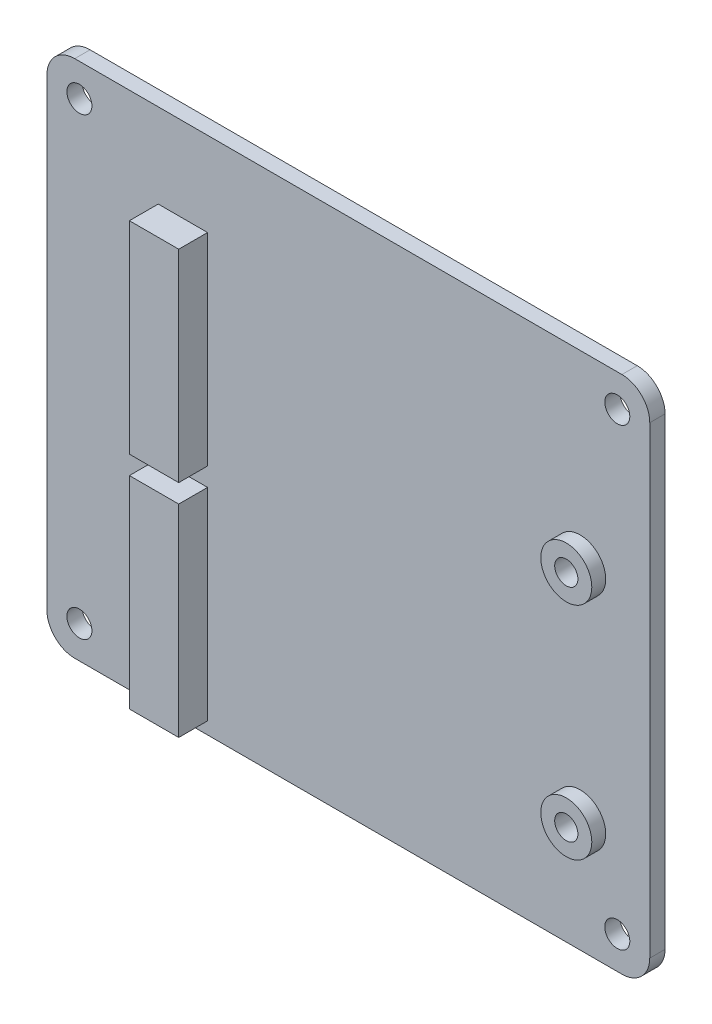
ISO-10303-21;
HEADER;
FILE_DESCRIPTION(('STEP AP214'),'2;1');
FILE_NAME('part.step','',(''),(''),'','','');
FILE_SCHEMA(('AUTOMOTIVE_DESIGN { 1 0 10303 214 1 1 1 1 }'));
ENDSEC;
DATA;
#1=APPLICATION_CONTEXT('core data for automotive mechanical design processes');
#2=APPLICATION_PROTOCOL_DEFINITION('international standard','automotive_design',2000,#1);
#3=PRODUCT_CONTEXT('',#1,'mechanical');
#4=PRODUCT('Part','Part','',(#3));
#5=PRODUCT_RELATED_PRODUCT_CATEGORY('part','',(#4));
#6=PRODUCT_DEFINITION_FORMATION('','',#4);
#7=PRODUCT_DEFINITION_CONTEXT('part definition',#1,'design');
#8=PRODUCT_DEFINITION('design','',#6,#7);
#9=PRODUCT_DEFINITION_SHAPE('','',#8);
#10=(LENGTH_UNIT() NAMED_UNIT(*) SI_UNIT(.MILLI.,.METRE.));
#11=(NAMED_UNIT(*) PLANE_ANGLE_UNIT() SI_UNIT($,.RADIAN.));
#12=(NAMED_UNIT(*) SI_UNIT($,.STERADIAN.) SOLID_ANGLE_UNIT());
#13=UNCERTAINTY_MEASURE_WITH_UNIT(LENGTH_MEASURE(1.E-05),#10,'distance_accuracy_value','');
#14=(GEOMETRIC_REPRESENTATION_CONTEXT(3) GLOBAL_UNCERTAINTY_ASSIGNED_CONTEXT((#13)) GLOBAL_UNIT_ASSIGNED_CONTEXT((#10,
#11,#12)) REPRESENTATION_CONTEXT('',''));
#15=CARTESIAN_POINT('',(0.,0.,0.));
#16=DIRECTION('',(0.,0.,1.));
#17=DIRECTION('',(1.,0.,0.));
#18=AXIS2_PLACEMENT_3D('',#15,#16,#17);
#19=CARTESIAN_POINT('',(-10.7638714223459,176.226790528079,-199.671110375751));
#20=DIRECTION('',(0.,0.,-1.));
#21=DIRECTION('',(-1.,0.,0.));
#22=AXIS2_PLACEMENT_3D('',#19,#20,#21);
#23=PLANE('',#22);
#24=CARTESIAN_POINT('',(-15.2638714223459,159.246790528079,-199.671110375751));
#25=DIRECTION('',(0.,0.,-1.));
#26=DIRECTION('',(-1.,0.,0.));
#27=AXIS2_PLACEMENT_3D('',#24,#25,#26);
#28=CIRCLE('',#27,2.75);
#29=CARTESIAN_POINT('',(-18.0138714223459,159.246790528079,-199.671110375751));
#30=VERTEX_POINT('',#29);
#31=EDGE_CURVE('E11',#30,#30,#28,.F.);
#32=ORIENTED_EDGE('',*,*,#31,.F.);
#33=EDGE_LOOP('',(#32));
#34=FACE_BOUND('',#33,.T.);
#35=CARTESIAN_POINT('',(-15.2638714223459,135.446790528079,-199.671110375751));
#36=DIRECTION('',(0.,0.,-1.));
#37=DIRECTION('',(-1.,0.,0.));
#38=AXIS2_PLACEMENT_3D('',#35,#36,#37);
#39=CIRCLE('',#38,2.75);
#40=CARTESIAN_POINT('',(-18.0138714223459,135.446790528079,-199.671110375751));
#41=VERTEX_POINT('',#40);
#42=EDGE_CURVE('E46',#41,#41,#39,.F.);
#43=ORIENTED_EDGE('',*,*,#42,.F.);
#44=EDGE_LOOP('',(#43));
#45=FACE_BOUND('',#44,.T.);
#46=DIRECTION('',(0.,-1.,0.));
#47=VECTOR('',#46,1.);
#48=CARTESIAN_POINT('',(-60.7638714223459,170.146790528079,-199.671110375751));
#49=LINE('',#48,#47);
#50=CARTESIAN_POINT('',(-60.7638714223459,170.146790528079,-199.671110375751));
#51=VERTEX_POINT('',#50);
#52=CARTESIAN_POINT('',(-60.7638714223459,148.346790528079,-199.671110375751));
#53=VERTEX_POINT('',#52);
#54=EDGE_CURVE('E153',#51,#53,#49,.T.);
#55=ORIENTED_EDGE('',*,*,#54,.F.);
#56=DIRECTION('',(-1.,0.,0.));
#57=VECTOR('',#56,1.);
#58=CARTESIAN_POINT('',(-60.7638714223459,170.146790528079,-199.671110375751));
#59=LINE('',#58,#57);
#60=CARTESIAN_POINT('',(-55.4438714223459,170.146790528079,-199.671110375751));
#61=VERTEX_POINT('',#60);
#62=EDGE_CURVE('E186',#61,#51,#59,.T.);
#63=ORIENTED_EDGE('',*,*,#62,.F.);
#64=DIRECTION('',(0.,1.,0.));
#65=VECTOR('',#64,1.);
#66=CARTESIAN_POINT('',(-55.4438714223459,170.146790528079,-199.671110375751));
#67=LINE('',#66,#65);
#68=CARTESIAN_POINT('',(-55.4438714223459,148.346790528079,-199.671110375751));
#69=VERTEX_POINT('',#68);
#70=EDGE_CURVE('E198',#69,#61,#67,.T.);
#71=ORIENTED_EDGE('',*,*,#70,.F.);
#72=DIRECTION('',(1.,0.,0.));
#73=VECTOR('',#72,1.);
#74=CARTESIAN_POINT('',(-60.7638714223459,148.346790528079,-199.671110375751));
#75=LINE('',#74,#73);
#76=EDGE_CURVE('E195',#53,#69,#75,.T.);
#77=ORIENTED_EDGE('',*,*,#76,.F.);
#78=EDGE_LOOP('',(#55,#63,#71,#77));
#79=FACE_BOUND('',#78,.T.);
#80=CARTESIAN_POINT('',(-11.2638714223459,175.726790528079,-199.671110375751));
#81=DIRECTION('',(0.,0.,1.));
#82=DIRECTION('',(1.,0.,0.));
#83=AXIS2_PLACEMENT_3D('',#80,#81,#82);
#84=CIRCLE('',#83,1.34999999999998);
#85=CARTESIAN_POINT('',(-9.91387142234592,175.726790528079,-199.671110375751));
#86=VERTEX_POINT('',#85);
#87=EDGE_CURVE('E221',#86,#86,#84,.T.);
#88=ORIENTED_EDGE('',*,*,#87,.F.);
#89=EDGE_LOOP('',(#88));
#90=FACE_BOUND('',#89,.T.);
#91=CARTESIAN_POINT('',(-69.2638714223459,126.726790528079,-199.671110375751));
#92=DIRECTION('',(0.,0.,1.));
#93=DIRECTION('',(1.,0.,0.));
#94=AXIS2_PLACEMENT_3D('',#91,#92,#93);
#95=CIRCLE('',#94,1.35);
#96=CARTESIAN_POINT('',(-67.9138714223459,126.726790528079,-199.671110375751));
#97=VERTEX_POINT('',#96);
#98=EDGE_CURVE('E228',#97,#97,#95,.T.);
#99=ORIENTED_EDGE('',*,*,#98,.F.);
#100=EDGE_LOOP('',(#99));
#101=FACE_BOUND('',#100,.T.);
#102=CARTESIAN_POINT('',(-11.2638714223459,126.726790528079,-199.671110375751));
#103=DIRECTION('',(0.,0.,1.));
#104=DIRECTION('',(1.,0.,0.));
#105=AXIS2_PLACEMENT_3D('',#102,#103,#104);
#106=CIRCLE('',#105,1.34999999999998);
#107=CARTESIAN_POINT('',(-9.91387142234592,126.726790528079,-199.671110375751));
#108=VERTEX_POINT('',#107);
#109=EDGE_CURVE('E215',#108,#108,#106,.T.);
#110=ORIENTED_EDGE('',*,*,#109,.F.);
#111=EDGE_LOOP('',(#110));
#112=FACE_BOUND('',#111,.T.);
#113=CARTESIAN_POINT('',(-69.2638714223459,175.726790528079,-199.671110375751));
#114=DIRECTION('',(0.,0.,1.));
#115=DIRECTION('',(1.,0.,0.));
#116=AXIS2_PLACEMENT_3D('',#113,#114,#115);
#117=CIRCLE('',#116,1.35);
#118=CARTESIAN_POINT('',(-67.9138714223459,175.726790528079,-199.671110375751));
#119=VERTEX_POINT('',#118);
#120=EDGE_CURVE('E224',#119,#119,#117,.T.);
#121=ORIENTED_EDGE('',*,*,#120,.F.);
#122=EDGE_LOOP('',(#121));
#123=FACE_BOUND('',#122,.T.);
#124=CARTESIAN_POINT('',(-10.7638714223459,176.226790528079,-199.671110375751));
#125=DIRECTION('',(0.,0.,1.));
#126=DIRECTION('',(-1.,0.,0.));
#127=AXIS2_PLACEMENT_3D('',#124,#125,#126);
#128=CIRCLE('',#127,3.);
#129=CARTESIAN_POINT('',(-7.76387142234591,176.226790528079,-199.671110375751));
#130=VERTEX_POINT('',#129);
#131=CARTESIAN_POINT('',(-10.7638714223459,179.226790528079,-199.671110375751));
#132=VERTEX_POINT('',#131);
#133=EDGE_CURVE('E239',#130,#132,#128,.T.);
#134=ORIENTED_EDGE('',*,*,#133,.T.);
#135=DIRECTION('',(-1.,0.,0.));
#136=VECTOR('',#135,1.);
#137=CARTESIAN_POINT('',(-69.7638714223459,179.226790528079,-199.671110375751));
#138=LINE('',#137,#136);
#139=CARTESIAN_POINT('',(-69.7638714223459,179.226790528079,-199.671110375751));
#140=VERTEX_POINT('',#139);
#141=EDGE_CURVE('E242',#132,#140,#138,.T.);
#142=ORIENTED_EDGE('',*,*,#141,.T.);
#143=CARTESIAN_POINT('',(-69.7638714223459,176.226790528079,-199.671110375751));
#144=DIRECTION('',(0.,0.,1.));
#145=DIRECTION('',(1.,0.,0.));
#146=AXIS2_PLACEMENT_3D('',#143,#144,#145);
#147=CIRCLE('',#146,3.);
#148=CARTESIAN_POINT('',(-72.7638714223459,176.226790528079,-199.671110375751));
#149=VERTEX_POINT('',#148);
#150=EDGE_CURVE('E245',#140,#149,#147,.T.);
#151=ORIENTED_EDGE('',*,*,#150,.T.);
#152=DIRECTION('',(0.,-1.,0.));
#153=VECTOR('',#152,1.);
#154=CARTESIAN_POINT('',(-72.7638714223459,176.226790528079,-199.671110375751));
#155=LINE('',#154,#153);
#156=CARTESIAN_POINT('',(-72.7638714223459,126.226790528079,-199.671110375751));
#157=VERTEX_POINT('',#156);
#158=EDGE_CURVE('E247',#149,#157,#155,.T.);
#159=ORIENTED_EDGE('',*,*,#158,.T.);
#160=CARTESIAN_POINT('',(-69.7638714223459,126.226790528079,-199.671110375751));
#161=DIRECTION('',(0.,0.,1.));
#162=DIRECTION('',(1.,0.,0.));
#163=AXIS2_PLACEMENT_3D('',#160,#161,#162);
#164=CIRCLE('',#163,3.);
#165=CARTESIAN_POINT('',(-69.7638714223459,123.226790528079,-199.671110375751));
#166=VERTEX_POINT('',#165);
#167=EDGE_CURVE('E249',#157,#166,#164,.T.);
#168=ORIENTED_EDGE('',*,*,#167,.T.);
#169=DIRECTION('',(1.,0.,0.));
#170=VECTOR('',#169,1.);
#171=CARTESIAN_POINT('',(-69.7638714223459,123.226790528079,-199.671110375751));
#172=LINE('',#171,#170);
#173=CARTESIAN_POINT('',(-10.7638714223459,123.226790528079,-199.671110375751));
#174=VERTEX_POINT('',#173);
#175=EDGE_CURVE('E251',#166,#174,#172,.T.);
#176=ORIENTED_EDGE('',*,*,#175,.T.);
#177=CARTESIAN_POINT('',(-10.7638714223459,126.226790528079,-199.671110375751));
#178=DIRECTION('',(0.,0.,1.));
#179=DIRECTION('',(1.,0.,0.));
#180=AXIS2_PLACEMENT_3D('',#177,#178,#179);
#181=CIRCLE('',#180,3.);
#182=CARTESIAN_POINT('',(-7.76387142234591,126.226790528079,-199.671110375751));
#183=VERTEX_POINT('',#182);
#184=EDGE_CURVE('E253',#174,#183,#181,.T.);
#185=ORIENTED_EDGE('',*,*,#184,.T.);
#186=DIRECTION('',(0.,1.,0.));
#187=VECTOR('',#186,1.);
#188=CARTESIAN_POINT('',(-7.76387142234591,176.226790528079,-199.671110375751));
#189=LINE('',#188,#187);
#190=EDGE_CURVE('E255',#183,#130,#189,.T.);
#191=ORIENTED_EDGE('',*,*,#190,.T.);
#192=EDGE_LOOP('',(#134,#142,#151,#159,#168,#176,#185,#191));
#193=FACE_BOUND('',#192,.T.);
#194=DIRECTION('',(0.,-1.,0.));
#195=VECTOR('',#194,1.);
#196=CARTESIAN_POINT('',(-60.7638714223459,146.346790528079,-199.671110375751));
#197=LINE('',#196,#195);
#198=CARTESIAN_POINT('',(-60.7638714223459,146.346790528079,-199.671110375751));
#199=VERTEX_POINT('',#198);
#200=CARTESIAN_POINT('',(-60.7638714223459,124.546790528079,-199.671110375751));
#201=VERTEX_POINT('',#200);
#202=EDGE_CURVE('E147',#199,#201,#197,.T.);
#203=ORIENTED_EDGE('',*,*,#202,.F.);
#204=DIRECTION('',(-1.,0.,0.));
#205=VECTOR('',#204,1.);
#206=CARTESIAN_POINT('',(-60.7638714223459,146.346790528079,-199.671110375751));
#207=LINE('',#206,#205);
#208=CARTESIAN_POINT('',(-55.4438714223459,146.346790528079,-199.671110375751));
#209=VERTEX_POINT('',#208);
#210=EDGE_CURVE('E149',#209,#199,#207,.T.);
#211=ORIENTED_EDGE('',*,*,#210,.F.);
#212=DIRECTION('',(0.,1.,0.));
#213=VECTOR('',#212,1.);
#214=CARTESIAN_POINT('',(-55.4438714223459,146.346790528079,-199.671110375751));
#215=LINE('',#214,#213);
#216=CARTESIAN_POINT('',(-55.4438714223459,124.546790528079,-199.671110375751));
#217=VERTEX_POINT('',#216);
#218=EDGE_CURVE('E58',#217,#209,#215,.T.);
#219=ORIENTED_EDGE('',*,*,#218,.F.);
#220=DIRECTION('',(1.,0.,0.));
#221=VECTOR('',#220,1.);
#222=CARTESIAN_POINT('',(-60.7638714223459,124.546790528079,-199.671110375751));
#223=LINE('',#222,#221);
#224=EDGE_CURVE('E53',#201,#217,#223,.T.);
#225=ORIENTED_EDGE('',*,*,#224,.F.);
#226=EDGE_LOOP('',(#203,#211,#219,#225));
#227=FACE_BOUND('',#226,.T.);
#228=ADVANCED_FACE('F38',(#34,#45,#79,#90,#101,#112,#123,#193,#227),#23,.F.);
#229=CARTESIAN_POINT('',(-10.7638714223459,176.226790528079,-199.671110375751));
#230=DIRECTION('',(0.,0.,-1.));
#231=DIRECTION('',(-1.,0.,0.));
#232=AXIS2_PLACEMENT_3D('',#229,#230,#231);
#233=CYLINDRICAL_SURFACE('',#232,3.);
#234=CARTESIAN_POINT('',(-10.7638714223459,176.226790528079,-201.321110375751));
#235=DIRECTION('',(0.,0.,1.));
#236=DIRECTION('',(-1.,0.,0.));
#237=AXIS2_PLACEMENT_3D('',#234,#235,#236);
#238=CIRCLE('',#237,3.);
#239=CARTESIAN_POINT('',(-7.76387142234591,176.226790528079,-201.321110375751));
#240=VERTEX_POINT('',#239);
#241=CARTESIAN_POINT('',(-10.7638714223459,179.226790528079,-201.321110375751));
#242=VERTEX_POINT('',#241);
#243=EDGE_CURVE('E236',#240,#242,#238,.T.);
#244=ORIENTED_EDGE('',*,*,#243,.T.);
#245=DIRECTION('',(0.,0.,-1.));
#246=VECTOR('',#245,1.);
#247=CARTESIAN_POINT('',(-10.7638714223459,179.226790528079,-199.671110375751));
#248=LINE('',#247,#246);
#249=EDGE_CURVE('E293',#132,#242,#248,.T.);
#250=ORIENTED_EDGE('',*,*,#249,.F.);
#251=ORIENTED_EDGE('',*,*,#133,.F.);
#252=DIRECTION('',(0.,0.,-1.));
#253=VECTOR('',#252,1.);
#254=CARTESIAN_POINT('',(-7.76387142234591,176.226790528079,-199.671110375751));
#255=LINE('',#254,#253);
#256=EDGE_CURVE('E257',#130,#240,#255,.T.);
#257=ORIENTED_EDGE('',*,*,#256,.T.);
#258=EDGE_LOOP('',(#244,#250,#251,#257));
#259=FACE_BOUND('',#258,.T.);
#260=ADVANCED_FACE('F40',(#259),#233,.T.);
#261=CARTESIAN_POINT('',(-69.7638714223459,179.226790528079,-199.671110375751));
#262=DIRECTION('',(0.,-1.,0.));
#263=DIRECTION('',(0.,0.,-1.));
#264=AXIS2_PLACEMENT_3D('',#261,#262,#263);
#265=PLANE('',#264);
#266=DIRECTION('',(-1.,0.,0.));
#267=VECTOR('',#266,1.);
#268=CARTESIAN_POINT('',(-69.7638714223459,179.226790528079,-201.321110375751));
#269=LINE('',#268,#267);
#270=CARTESIAN_POINT('',(-69.7638714223459,179.226790528079,-201.321110375751));
#271=VERTEX_POINT('',#270);
#272=EDGE_CURVE('E260',#242,#271,#269,.T.);
#273=ORIENTED_EDGE('',*,*,#272,.T.);
#274=DIRECTION('',(0.,0.,-1.));
#275=VECTOR('',#274,1.);
#276=CARTESIAN_POINT('',(-69.7638714223459,179.226790528079,-199.671110375751));
#277=LINE('',#276,#275);
#278=EDGE_CURVE('E290',#140,#271,#277,.T.);
#279=ORIENTED_EDGE('',*,*,#278,.F.);
#280=ORIENTED_EDGE('',*,*,#141,.F.);
#281=ORIENTED_EDGE('',*,*,#249,.T.);
#282=EDGE_LOOP('',(#273,#279,#280,#281));
#283=FACE_BOUND('',#282,.T.);
#284=ADVANCED_FACE('F321',(#283),#265,.F.);
#285=CARTESIAN_POINT('',(-69.7638714223459,176.226790528079,-199.671110375751));
#286=DIRECTION('',(0.,0.,-1.));
#287=DIRECTION('',(-1.,0.,0.));
#288=AXIS2_PLACEMENT_3D('',#285,#286,#287);
#289=CYLINDRICAL_SURFACE('',#288,3.);
#290=CARTESIAN_POINT('',(-69.7638714223459,176.226790528079,-201.321110375751));
#291=DIRECTION('',(0.,0.,1.));
#292=DIRECTION('',(1.,0.,0.));
#293=AXIS2_PLACEMENT_3D('',#290,#291,#292);
#294=CIRCLE('',#293,3.);
#295=CARTESIAN_POINT('',(-72.7638714223459,176.226790528079,-201.321110375751));
#296=VERTEX_POINT('',#295);
#297=EDGE_CURVE('E262',#271,#296,#294,.T.);
#298=ORIENTED_EDGE('',*,*,#297,.T.);
#299=DIRECTION('',(0.,0.,-1.));
#300=VECTOR('',#299,1.);
#301=CARTESIAN_POINT('',(-72.7638714223459,176.226790528079,-199.671110375751));
#302=LINE('',#301,#300);
#303=EDGE_CURVE('E287',#149,#296,#302,.T.);
#304=ORIENTED_EDGE('',*,*,#303,.F.);
#305=ORIENTED_EDGE('',*,*,#150,.F.);
#306=ORIENTED_EDGE('',*,*,#278,.T.);
#307=EDGE_LOOP('',(#298,#304,#305,#306));
#308=FACE_BOUND('',#307,.T.);
#309=ADVANCED_FACE('F326',(#308),#289,.T.);
#310=CARTESIAN_POINT('',(-72.7638714223459,176.226790528079,-199.671110375751));
#311=DIRECTION('',(1.,0.,0.));
#312=DIRECTION('',(0.,0.,-1.));
#313=AXIS2_PLACEMENT_3D('',#310,#311,#312);
#314=PLANE('',#313);
#315=DIRECTION('',(0.,-1.,0.));
#316=VECTOR('',#315,1.);
#317=CARTESIAN_POINT('',(-72.7638714223459,176.226790528079,-201.321110375751));
#318=LINE('',#317,#316);
#319=CARTESIAN_POINT('',(-72.7638714223459,126.226790528079,-201.321110375751));
#320=VERTEX_POINT('',#319);
#321=EDGE_CURVE('E264',#296,#320,#318,.T.);
#322=ORIENTED_EDGE('',*,*,#321,.T.);
#323=DIRECTION('',(0.,0.,-1.));
#324=VECTOR('',#323,1.);
#325=CARTESIAN_POINT('',(-72.7638714223459,126.226790528079,-199.671110375751));
#326=LINE('',#325,#324);
#327=EDGE_CURVE('E284',#157,#320,#326,.T.);
#328=ORIENTED_EDGE('',*,*,#327,.F.);
#329=ORIENTED_EDGE('',*,*,#158,.F.);
#330=ORIENTED_EDGE('',*,*,#303,.T.);
#331=EDGE_LOOP('',(#322,#328,#329,#330));
#332=FACE_BOUND('',#331,.T.);
#333=ADVANCED_FACE('F332',(#332),#314,.F.);
#334=CARTESIAN_POINT('',(-69.7638714223459,126.226790528079,-199.671110375751));
#335=DIRECTION('',(0.,0.,-1.));
#336=DIRECTION('',(-1.,0.,0.));
#337=AXIS2_PLACEMENT_3D('',#334,#335,#336);
#338=CYLINDRICAL_SURFACE('',#337,3.);
#339=CARTESIAN_POINT('',(-69.7638714223459,126.226790528079,-201.321110375751));
#340=DIRECTION('',(0.,0.,1.));
#341=DIRECTION('',(1.,0.,0.));
#342=AXIS2_PLACEMENT_3D('',#339,#340,#341);
#343=CIRCLE('',#342,3.);
#344=CARTESIAN_POINT('',(-69.7638714223459,123.226790528079,-201.321110375751));
#345=VERTEX_POINT('',#344);
#346=EDGE_CURVE('E266',#320,#345,#343,.T.);
#347=ORIENTED_EDGE('',*,*,#346,.T.);
#348=DIRECTION('',(0.,0.,-1.));
#349=VECTOR('',#348,1.);
#350=CARTESIAN_POINT('',(-69.7638714223459,123.226790528079,-199.671110375751));
#351=LINE('',#350,#349);
#352=EDGE_CURVE('E281',#166,#345,#351,.T.);
#353=ORIENTED_EDGE('',*,*,#352,.F.);
#354=ORIENTED_EDGE('',*,*,#167,.F.);
#355=ORIENTED_EDGE('',*,*,#327,.T.);
#356=EDGE_LOOP('',(#347,#353,#354,#355));
#357=FACE_BOUND('',#356,.T.);
#358=ADVANCED_FACE('F336',(#357),#338,.T.);
#359=CARTESIAN_POINT('',(-69.7638714223459,123.226790528079,-199.671110375751));
#360=DIRECTION('',(0.,1.,0.));
#361=DIRECTION('',(0.,0.,1.));
#362=AXIS2_PLACEMENT_3D('',#359,#360,#361);
#363=PLANE('',#362);
#364=DIRECTION('',(1.,0.,0.));
#365=VECTOR('',#364,1.);
#366=CARTESIAN_POINT('',(-69.7638714223459,123.226790528079,-201.321110375751));
#367=LINE('',#366,#365);
#368=CARTESIAN_POINT('',(-10.7638714223459,123.226790528079,-201.321110375751));
#369=VERTEX_POINT('',#368);
#370=EDGE_CURVE('E268',#345,#369,#367,.T.);
#371=ORIENTED_EDGE('',*,*,#370,.T.);
#372=DIRECTION('',(0.,0.,-1.));
#373=VECTOR('',#372,1.);
#374=CARTESIAN_POINT('',(-10.7638714223459,123.226790528079,-199.671110375751));
#375=LINE('',#374,#373);
#376=EDGE_CURVE('E278',#174,#369,#375,.T.);
#377=ORIENTED_EDGE('',*,*,#376,.F.);
#378=ORIENTED_EDGE('',*,*,#175,.F.);
#379=ORIENTED_EDGE('',*,*,#352,.T.);
#380=EDGE_LOOP('',(#371,#377,#378,#379));
#381=FACE_BOUND('',#380,.T.);
#382=ADVANCED_FACE('F341',(#381),#363,.F.);
#383=CARTESIAN_POINT('',(-10.7638714223459,126.226790528079,-199.671110375751));
#384=DIRECTION('',(0.,0.,-1.));
#385=DIRECTION('',(-1.,0.,0.));
#386=AXIS2_PLACEMENT_3D('',#383,#384,#385);
#387=CYLINDRICAL_SURFACE('',#386,3.);
#388=CARTESIAN_POINT('',(-10.7638714223459,126.226790528079,-201.321110375751));
#389=DIRECTION('',(0.,0.,1.));
#390=DIRECTION('',(1.,0.,0.));
#391=AXIS2_PLACEMENT_3D('',#388,#389,#390);
#392=CIRCLE('',#391,3.);
#393=CARTESIAN_POINT('',(-7.76387142234591,126.226790528079,-201.321110375751));
#394=VERTEX_POINT('',#393);
#395=EDGE_CURVE('E270',#369,#394,#392,.T.);
#396=ORIENTED_EDGE('',*,*,#395,.T.);
#397=DIRECTION('',(0.,0.,-1.));
#398=VECTOR('',#397,1.);
#399=CARTESIAN_POINT('',(-7.76387142234591,126.226790528079,-199.671110375751));
#400=LINE('',#399,#398);
#401=EDGE_CURVE('E275',#183,#394,#400,.T.);
#402=ORIENTED_EDGE('',*,*,#401,.F.);
#403=ORIENTED_EDGE('',*,*,#184,.F.);
#404=ORIENTED_EDGE('',*,*,#376,.T.);
#405=EDGE_LOOP('',(#396,#402,#403,#404));
#406=FACE_BOUND('',#405,.T.);
#407=ADVANCED_FACE('F345',(#406),#387,.T.);
#408=CARTESIAN_POINT('',(-7.76387142234591,176.226790528079,-199.671110375751));
#409=DIRECTION('',(-1.,0.,0.));
#410=DIRECTION('',(0.,-1.,0.));
#411=AXIS2_PLACEMENT_3D('',#408,#409,#410);
#412=PLANE('',#411);
#413=DIRECTION('',(0.,1.,0.));
#414=VECTOR('',#413,1.);
#415=CARTESIAN_POINT('',(-7.76387142234591,176.226790528079,-201.321110375751));
#416=LINE('',#415,#414);
#417=EDGE_CURVE('E243',#394,#240,#416,.T.);
#418=ORIENTED_EDGE('',*,*,#417,.T.);
#419=ORIENTED_EDGE('',*,*,#256,.F.);
#420=ORIENTED_EDGE('',*,*,#190,.F.);
#421=ORIENTED_EDGE('',*,*,#401,.T.);
#422=EDGE_LOOP('',(#418,#419,#420,#421));
#423=FACE_BOUND('',#422,.T.);
#424=ADVANCED_FACE('F349',(#423),#412,.F.);
#425=CARTESIAN_POINT('',(-10.7638714223459,176.226790528079,-201.321110375751));
#426=DIRECTION('',(0.,0.,-1.));
#427=DIRECTION('',(-1.,0.,0.));
#428=AXIS2_PLACEMENT_3D('',#425,#426,#427);
#429=PLANE('',#428);
#430=CARTESIAN_POINT('',(-15.2638714223459,159.246790528079,-201.321110375751));
#431=DIRECTION('',(0.,0.,-1.));
#432=DIRECTION('',(-1.,0.,0.));
#433=AXIS2_PLACEMENT_3D('',#430,#431,#432);
#434=CIRCLE('',#433,1.25);
#435=CARTESIAN_POINT('',(-16.5138714223459,159.246790528079,-201.321110375751));
#436=VERTEX_POINT('',#435);
#437=EDGE_CURVE('E724',#436,#436,#434,.F.);
#438=ORIENTED_EDGE('',*,*,#437,.T.);
#439=EDGE_LOOP('',(#438));
#440=FACE_BOUND('',#439,.T.);
#441=CARTESIAN_POINT('',(-15.2638714223459,135.446790528079,-201.321110375751));
#442=DIRECTION('',(0.,0.,-1.));
#443=DIRECTION('',(-1.,0.,0.));
#444=AXIS2_PLACEMENT_3D('',#441,#442,#443);
#445=CIRCLE('',#444,1.25);
#446=CARTESIAN_POINT('',(-16.5138714223459,135.446790528079,-201.321110375751));
#447=VERTEX_POINT('',#446);
#448=EDGE_CURVE('E721',#447,#447,#445,.F.);
#449=ORIENTED_EDGE('',*,*,#448,.T.);
#450=EDGE_LOOP('',(#449));
#451=FACE_BOUND('',#450,.T.);
#452=CARTESIAN_POINT('',(-11.2638714223459,175.726790528079,-201.321110375751));
#453=DIRECTION('',(0.,0.,1.));
#454=DIRECTION('',(1.,0.,0.));
#455=AXIS2_PLACEMENT_3D('',#452,#453,#454);
#456=CIRCLE('',#455,1.34999999999998);
#457=CARTESIAN_POINT('',(-9.91387142234592,175.726790528079,-201.321110375751));
#458=VERTEX_POINT('',#457);
#459=EDGE_CURVE('E225',#458,#458,#456,.T.);
#460=ORIENTED_EDGE('',*,*,#459,.T.);
#461=EDGE_LOOP('',(#460));
#462=FACE_BOUND('',#461,.T.);
#463=CARTESIAN_POINT('',(-69.2638714223459,126.726790528079,-201.321110375751));
#464=DIRECTION('',(0.,0.,1.));
#465=DIRECTION('',(1.,0.,0.));
#466=AXIS2_PLACEMENT_3D('',#463,#464,#465);
#467=CIRCLE('',#466,1.35);
#468=CARTESIAN_POINT('',(-67.9138714223459,126.726790528079,-201.321110375751));
#469=VERTEX_POINT('',#468);
#470=EDGE_CURVE('E218',#469,#469,#467,.T.);
#471=ORIENTED_EDGE('',*,*,#470,.T.);
#472=EDGE_LOOP('',(#471));
#473=FACE_BOUND('',#472,.T.);
#474=CARTESIAN_POINT('',(-11.2638714223459,126.726790528079,-201.321110375751));
#475=DIRECTION('',(0.,0.,1.));
#476=DIRECTION('',(1.,0.,0.));
#477=AXIS2_PLACEMENT_3D('',#474,#475,#476);
#478=CIRCLE('',#477,1.34999999999998);
#479=CARTESIAN_POINT('',(-9.91387142234592,126.726790528079,-201.321110375751));
#480=VERTEX_POINT('',#479);
#481=EDGE_CURVE('E214',#480,#480,#478,.T.);
#482=ORIENTED_EDGE('',*,*,#481,.T.);
#483=EDGE_LOOP('',(#482));
#484=FACE_BOUND('',#483,.T.);
#485=CARTESIAN_POINT('',(-69.2638714223459,175.726790528079,-201.321110375751));
#486=DIRECTION('',(0.,0.,1.));
#487=DIRECTION('',(1.,0.,0.));
#488=AXIS2_PLACEMENT_3D('',#485,#486,#487);
#489=CIRCLE('',#488,1.35);
#490=CARTESIAN_POINT('',(-67.9138714223459,175.726790528079,-201.321110375751));
#491=VERTEX_POINT('',#490);
#492=EDGE_CURVE('E233',#491,#491,#489,.T.);
#493=ORIENTED_EDGE('',*,*,#492,.T.);
#494=EDGE_LOOP('',(#493));
#495=FACE_BOUND('',#494,.T.);
#496=ORIENTED_EDGE('',*,*,#243,.F.);
#497=ORIENTED_EDGE('',*,*,#417,.F.);
#498=ORIENTED_EDGE('',*,*,#395,.F.);
#499=ORIENTED_EDGE('',*,*,#370,.F.);
#500=ORIENTED_EDGE('',*,*,#346,.F.);
#501=ORIENTED_EDGE('',*,*,#321,.F.);
#502=ORIENTED_EDGE('',*,*,#297,.F.);
#503=ORIENTED_EDGE('',*,*,#272,.F.);
#504=EDGE_LOOP('',(#496,#497,#498,#499,#500,#501,#502,#503));
#505=FACE_BOUND('',#504,.T.);
#506=ADVANCED_FACE('F351',(#440,#451,#462,#473,#484,#495,#505),#429,.T.);
#507=CARTESIAN_POINT('',(-69.2638714223459,175.726790528079,-201.321110375751));
#508=DIRECTION('',(0.,0.,1.));
#509=DIRECTION('',(1.,0.,0.));
#510=AXIS2_PLACEMENT_3D('',#507,#508,#509);
#511=CYLINDRICAL_SURFACE('',#510,1.35);
#512=ORIENTED_EDGE('',*,*,#492,.F.);
#513=EDGE_LOOP('',(#512));
#514=FACE_BOUND('',#513,.T.);
#515=ORIENTED_EDGE('',*,*,#120,.T.);
#516=EDGE_LOOP('',(#515));
#517=FACE_BOUND('',#516,.T.);
#518=ADVANCED_FACE('F353',(#514,#517),#511,.F.);
#519=CARTESIAN_POINT('',(-11.2638714223459,126.726790528079,-201.321110375751));
#520=DIRECTION('',(0.,0.,1.));
#521=DIRECTION('',(1.,0.,0.));
#522=AXIS2_PLACEMENT_3D('',#519,#520,#521);
#523=CYLINDRICAL_SURFACE('',#522,1.34999999999998);
#524=ORIENTED_EDGE('',*,*,#481,.F.);
#525=EDGE_LOOP('',(#524));
#526=FACE_BOUND('',#525,.T.);
#527=ORIENTED_EDGE('',*,*,#109,.T.);
#528=EDGE_LOOP('',(#527));
#529=FACE_BOUND('',#528,.T.);
#530=ADVANCED_FACE('F360',(#526,#529),#523,.F.);
#531=CARTESIAN_POINT('',(-69.2638714223459,126.726790528079,-201.321110375751));
#532=DIRECTION('',(0.,0.,1.));
#533=DIRECTION('',(1.,0.,0.));
#534=AXIS2_PLACEMENT_3D('',#531,#532,#533);
#535=CYLINDRICAL_SURFACE('',#534,1.35);
#536=ORIENTED_EDGE('',*,*,#470,.F.);
#537=EDGE_LOOP('',(#536));
#538=FACE_BOUND('',#537,.T.);
#539=ORIENTED_EDGE('',*,*,#98,.T.);
#540=EDGE_LOOP('',(#539));
#541=FACE_BOUND('',#540,.T.);
#542=ADVANCED_FACE('F573',(#538,#541),#535,.F.);
#543=CARTESIAN_POINT('',(-11.2638714223459,175.726790528079,-201.321110375751));
#544=DIRECTION('',(0.,0.,1.));
#545=DIRECTION('',(1.,0.,0.));
#546=AXIS2_PLACEMENT_3D('',#543,#544,#545);
#547=CYLINDRICAL_SURFACE('',#546,1.34999999999998);
#548=ORIENTED_EDGE('',*,*,#459,.F.);
#549=EDGE_LOOP('',(#548));
#550=FACE_BOUND('',#549,.T.);
#551=ORIENTED_EDGE('',*,*,#87,.T.);
#552=EDGE_LOOP('',(#551));
#553=FACE_BOUND('',#552,.T.);
#554=ADVANCED_FACE('F562',(#550,#553),#547,.F.);
#555=CARTESIAN_POINT('',(-60.7638714223459,170.146790528079,-196.561110375751));
#556=DIRECTION('',(1.,0.,0.));
#557=DIRECTION('',(0.,1.,0.));
#558=AXIS2_PLACEMENT_3D('',#555,#556,#557);
#559=PLANE('',#558);
#560=ORIENTED_EDGE('',*,*,#54,.T.);
#561=DIRECTION('',(0.,0.,-1.));
#562=VECTOR('',#561,1.);
#563=CARTESIAN_POINT('',(-60.7638714223459,148.346790528079,-196.561110375751));
#564=LINE('',#563,#562);
#565=CARTESIAN_POINT('',(-60.7638714223459,148.346790528079,-196.561110375751));
#566=VERTEX_POINT('',#565);
#567=EDGE_CURVE('E211',#566,#53,#564,.T.);
#568=ORIENTED_EDGE('',*,*,#567,.F.);
#569=DIRECTION('',(0.,-1.,0.));
#570=VECTOR('',#569,1.);
#571=CARTESIAN_POINT('',(-60.7638714223459,170.146790528079,-196.561110375751));
#572=LINE('',#571,#570);
#573=CARTESIAN_POINT('',(-60.7638714223459,170.146790528079,-196.561110375751));
#574=VERTEX_POINT('',#573);
#575=EDGE_CURVE('E182',#574,#566,#572,.T.);
#576=ORIENTED_EDGE('',*,*,#575,.F.);
#577=DIRECTION('',(0.,0.,-1.));
#578=VECTOR('',#577,1.);
#579=CARTESIAN_POINT('',(-60.7638714223459,170.146790528079,-196.561110375751));
#580=LINE('',#579,#578);
#581=EDGE_CURVE('E192',#574,#51,#580,.T.);
#582=ORIENTED_EDGE('',*,*,#581,.T.);
#583=EDGE_LOOP('',(#560,#568,#576,#582));
#584=FACE_BOUND('',#583,.T.);
#585=ADVANCED_FACE('F554',(#584),#559,.F.);
#586=CARTESIAN_POINT('',(-60.7638714223459,148.346790528079,-196.561110375751));
#587=DIRECTION('',(0.,1.,0.));
#588=DIRECTION('',(0.,0.,1.));
#589=AXIS2_PLACEMENT_3D('',#586,#587,#588);
#590=PLANE('',#589);
#591=ORIENTED_EDGE('',*,*,#76,.T.);
#592=DIRECTION('',(0.,0.,-1.));
#593=VECTOR('',#592,1.);
#594=CARTESIAN_POINT('',(-55.4438714223459,148.346790528079,-196.561110375751));
#595=LINE('',#594,#593);
#596=CARTESIAN_POINT('',(-55.4438714223459,148.346790528079,-196.561110375751));
#597=VERTEX_POINT('',#596);
#598=EDGE_CURVE('E208',#597,#69,#595,.T.);
#599=ORIENTED_EDGE('',*,*,#598,.F.);
#600=DIRECTION('',(1.,0.,0.));
#601=VECTOR('',#600,1.);
#602=CARTESIAN_POINT('',(-60.7638714223459,148.346790528079,-196.561110375751));
#603=LINE('',#602,#601);
#604=EDGE_CURVE('E185',#566,#597,#603,.T.);
#605=ORIENTED_EDGE('',*,*,#604,.F.);
#606=ORIENTED_EDGE('',*,*,#567,.T.);
#607=EDGE_LOOP('',(#591,#599,#605,#606));
#608=FACE_BOUND('',#607,.T.);
#609=ADVANCED_FACE('F544',(#608),#590,.F.);
#610=CARTESIAN_POINT('',(-55.4438714223459,170.146790528079,-196.561110375751));
#611=DIRECTION('',(-1.,0.,0.));
#612=DIRECTION('',(0.,-1.,0.));
#613=AXIS2_PLACEMENT_3D('',#610,#611,#612);
#614=PLANE('',#613);
#615=ORIENTED_EDGE('',*,*,#70,.T.);
#616=DIRECTION('',(0.,0.,-1.));
#617=VECTOR('',#616,1.);
#618=CARTESIAN_POINT('',(-55.4438714223459,170.146790528079,-196.561110375751));
#619=LINE('',#618,#617);
#620=CARTESIAN_POINT('',(-55.4438714223459,170.146790528079,-196.561110375751));
#621=VERTEX_POINT('',#620);
#622=EDGE_CURVE('E205',#621,#61,#619,.T.);
#623=ORIENTED_EDGE('',*,*,#622,.F.);
#624=DIRECTION('',(0.,1.,0.));
#625=VECTOR('',#624,1.);
#626=CARTESIAN_POINT('',(-55.4438714223459,170.146790528079,-196.561110375751));
#627=LINE('',#626,#625);
#628=EDGE_CURVE('E188',#597,#621,#627,.T.);
#629=ORIENTED_EDGE('',*,*,#628,.F.);
#630=ORIENTED_EDGE('',*,*,#598,.T.);
#631=EDGE_LOOP('',(#615,#623,#629,#630));
#632=FACE_BOUND('',#631,.T.);
#633=ADVANCED_FACE('F534',(#632),#614,.F.);
#634=CARTESIAN_POINT('',(-60.7638714223459,170.146790528079,-196.561110375751));
#635=DIRECTION('',(0.,-1.,0.));
#636=DIRECTION('',(0.,0.,-1.));
#637=AXIS2_PLACEMENT_3D('',#634,#635,#636);
#638=PLANE('',#637);
#639=ORIENTED_EDGE('',*,*,#62,.T.);
#640=ORIENTED_EDGE('',*,*,#581,.F.);
#641=DIRECTION('',(-1.,0.,0.));
#642=VECTOR('',#641,1.);
#643=CARTESIAN_POINT('',(-60.7638714223459,170.146790528079,-196.561110375751));
#644=LINE('',#643,#642);
#645=EDGE_CURVE('E190',#621,#574,#644,.T.);
#646=ORIENTED_EDGE('',*,*,#645,.F.);
#647=ORIENTED_EDGE('',*,*,#622,.T.);
#648=EDGE_LOOP('',(#639,#640,#646,#647));
#649=FACE_BOUND('',#648,.T.);
#650=ADVANCED_FACE('F524',(#649),#638,.F.);
#651=CARTESIAN_POINT('',(0.,0.,-196.561110375751));
#652=DIRECTION('',(0.,0.,1.));
#653=DIRECTION('',(1.,0.,0.));
#654=AXIS2_PLACEMENT_3D('',#651,#652,#653);
#655=PLANE('',#654);
#656=ORIENTED_EDGE('',*,*,#575,.T.);
#657=ORIENTED_EDGE('',*,*,#604,.T.);
#658=ORIENTED_EDGE('',*,*,#628,.T.);
#659=ORIENTED_EDGE('',*,*,#645,.T.);
#660=EDGE_LOOP('',(#656,#657,#658,#659));
#661=FACE_BOUND('',#660,.T.);
#662=ADVANCED_FACE('F515',(#661),#655,.T.);
#663=CARTESIAN_POINT('',(-60.7638714223459,146.346790528079,-196.561110375751));
#664=DIRECTION('',(1.,0.,0.));
#665=DIRECTION('',(0.,0.,-1.));
#666=AXIS2_PLACEMENT_3D('',#663,#664,#665);
#667=PLANE('',#666);
#668=ORIENTED_EDGE('',*,*,#202,.T.);
#669=DIRECTION('',(0.,0.,-1.));
#670=VECTOR('',#669,1.);
#671=CARTESIAN_POINT('',(-60.7638714223459,124.546790528079,-196.561110375751));
#672=LINE('',#671,#670);
#673=CARTESIAN_POINT('',(-60.7638714223459,124.546790528079,-196.561110375751));
#674=VERTEX_POINT('',#673);
#675=EDGE_CURVE('E708',#674,#201,#672,.T.);
#676=ORIENTED_EDGE('',*,*,#675,.F.);
#677=DIRECTION('',(0.,-1.,0.));
#678=VECTOR('',#677,1.);
#679=CARTESIAN_POINT('',(-60.7638714223459,146.346790528079,-196.561110375751));
#680=LINE('',#679,#678);
#681=CARTESIAN_POINT('',(-60.7638714223459,146.346790528079,-196.561110375751));
#682=VERTEX_POINT('',#681);
#683=EDGE_CURVE('E164',#682,#674,#680,.T.);
#684=ORIENTED_EDGE('',*,*,#683,.F.);
#685=DIRECTION('',(0.,0.,-1.));
#686=VECTOR('',#685,1.);
#687=CARTESIAN_POINT('',(-60.7638714223459,146.346790528079,-196.561110375751));
#688=LINE('',#687,#686);
#689=EDGE_CURVE('E160',#682,#199,#688,.T.);
#690=ORIENTED_EDGE('',*,*,#689,.T.);
#691=EDGE_LOOP('',(#668,#676,#684,#690));
#692=FACE_BOUND('',#691,.T.);
#693=ADVANCED_FACE('F166',(#692),#667,.F.);
#694=CARTESIAN_POINT('',(-60.7638714223459,124.546790528079,-196.561110375751));
#695=DIRECTION('',(0.,1.,0.));
#696=DIRECTION('',(0.,0.,1.));
#697=AXIS2_PLACEMENT_3D('',#694,#695,#696);
#698=PLANE('',#697);
#699=ORIENTED_EDGE('',*,*,#224,.T.);
#700=DIRECTION('',(0.,0.,-1.));
#701=VECTOR('',#700,1.);
#702=CARTESIAN_POINT('',(-55.4438714223459,124.546790528079,-196.561110375751));
#703=LINE('',#702,#701);
#704=CARTESIAN_POINT('',(-55.4438714223459,124.546790528079,-196.561110375751));
#705=VERTEX_POINT('',#704);
#706=EDGE_CURVE('E172',#705,#217,#703,.T.);
#707=ORIENTED_EDGE('',*,*,#706,.F.);
#708=DIRECTION('',(1.,0.,0.));
#709=VECTOR('',#708,1.);
#710=CARTESIAN_POINT('',(-60.7638714223459,124.546790528079,-196.561110375751));
#711=LINE('',#710,#709);
#712=EDGE_CURVE('E179',#674,#705,#711,.T.);
#713=ORIENTED_EDGE('',*,*,#712,.F.);
#714=ORIENTED_EDGE('',*,*,#675,.T.);
#715=EDGE_LOOP('',(#699,#707,#713,#714));
#716=FACE_BOUND('',#715,.T.);
#717=ADVANCED_FACE('F496',(#716),#698,.F.);
#718=CARTESIAN_POINT('',(-55.4438714223459,146.346790528079,-196.561110375751));
#719=DIRECTION('',(-1.,0.,0.));
#720=DIRECTION('',(0.,0.,1.));
#721=AXIS2_PLACEMENT_3D('',#718,#719,#720);
#722=PLANE('',#721);
#723=ORIENTED_EDGE('',*,*,#218,.T.);
#724=DIRECTION('',(0.,0.,-1.));
#725=VECTOR('',#724,1.);
#726=CARTESIAN_POINT('',(-55.4438714223459,146.346790528079,-196.561110375751));
#727=LINE('',#726,#725);
#728=CARTESIAN_POINT('',(-55.4438714223459,146.346790528079,-196.561110375751));
#729=VERTEX_POINT('',#728);
#730=EDGE_CURVE('E163',#729,#209,#727,.T.);
#731=ORIENTED_EDGE('',*,*,#730,.F.);
#732=DIRECTION('',(0.,1.,0.));
#733=VECTOR('',#732,1.);
#734=CARTESIAN_POINT('',(-55.4438714223459,146.346790528079,-196.561110375751));
#735=LINE('',#734,#733);
#736=EDGE_CURVE('E170',#705,#729,#735,.T.);
#737=ORIENTED_EDGE('',*,*,#736,.F.);
#738=ORIENTED_EDGE('',*,*,#706,.T.);
#739=EDGE_LOOP('',(#723,#731,#737,#738));
#740=FACE_BOUND('',#739,.T.);
#741=ADVANCED_FACE('F488',(#740),#722,.F.);
#742=CARTESIAN_POINT('',(-60.7638714223459,146.346790528079,-196.561110375751));
#743=DIRECTION('',(0.,-1.,0.));
#744=DIRECTION('',(0.,0.,-1.));
#745=AXIS2_PLACEMENT_3D('',#742,#743,#744);
#746=PLANE('',#745);
#747=ORIENTED_EDGE('',*,*,#210,.T.);
#748=ORIENTED_EDGE('',*,*,#689,.F.);
#749=DIRECTION('',(-1.,0.,0.));
#750=VECTOR('',#749,1.);
#751=CARTESIAN_POINT('',(-60.7638714223459,146.346790528079,-196.561110375751));
#752=LINE('',#751,#750);
#753=EDGE_CURVE('E168',#729,#682,#752,.T.);
#754=ORIENTED_EDGE('',*,*,#753,.F.);
#755=ORIENTED_EDGE('',*,*,#730,.T.);
#756=EDGE_LOOP('',(#747,#748,#754,#755));
#757=FACE_BOUND('',#756,.T.);
#758=ADVANCED_FACE('F158',(#757),#746,.F.);
#759=CARTESIAN_POINT('',(0.,0.,-196.561110375751));
#760=DIRECTION('',(0.,0.,1.));
#761=DIRECTION('',(1.,0.,0.));
#762=AXIS2_PLACEMENT_3D('',#759,#760,#761);
#763=PLANE('',#762);
#764=ORIENTED_EDGE('',*,*,#683,.T.);
#765=ORIENTED_EDGE('',*,*,#712,.T.);
#766=ORIENTED_EDGE('',*,*,#736,.T.);
#767=ORIENTED_EDGE('',*,*,#753,.T.);
#768=EDGE_LOOP('',(#764,#765,#766,#767));
#769=FACE_BOUND('',#768,.T.);
#770=ADVANCED_FACE('F395',(#769),#763,.T.);
#771=CARTESIAN_POINT('',(-15.2638714223459,135.446790528079,-198.171110375751));
#772=DIRECTION('',(0.,0.,-1.));
#773=DIRECTION('',(-1.,0.,0.));
#774=AXIS2_PLACEMENT_3D('',#771,#772,#773);
#775=CYLINDRICAL_SURFACE('',#774,2.75);
#776=CARTESIAN_POINT('',(-15.2638714223459,135.446790528079,-198.171110375751));
#777=DIRECTION('',(0.,0.,1.));
#778=DIRECTION('',(1.,0.,0.));
#779=AXIS2_PLACEMENT_3D('',#776,#777,#778);
#780=CIRCLE('',#779,2.75);
#781=CARTESIAN_POINT('',(-12.5138714223459,135.446790528079,-198.171110375751));
#782=VERTEX_POINT('',#781);
#783=EDGE_CURVE('E709',#782,#782,#780,.T.);
#784=ORIENTED_EDGE('',*,*,#783,.F.);
#785=EDGE_LOOP('',(#784));
#786=FACE_BOUND('',#785,.T.);
#787=ORIENTED_EDGE('',*,*,#42,.T.);
#788=EDGE_LOOP('',(#787));
#789=FACE_BOUND('',#788,.T.);
#790=ADVANCED_FACE('F298',(#786,#789),#775,.T.);
#791=CARTESIAN_POINT('',(-15.2638714223459,135.446790528079,-198.171110375751));
#792=DIRECTION('',(0.,0.,1.));
#793=DIRECTION('',(1.,0.,0.));
#794=AXIS2_PLACEMENT_3D('',#791,#792,#793);
#795=PLANE('',#794);
#796=CARTESIAN_POINT('',(-15.2638714223459,135.446790528079,-198.171110375751));
#797=DIRECTION('',(0.,0.,1.));
#798=DIRECTION('',(1.,0.,0.));
#799=AXIS2_PLACEMENT_3D('',#796,#797,#798);
#800=CIRCLE('',#799,1.25);
#801=CARTESIAN_POINT('',(-14.0138714223459,135.446790528079,-198.171110375751));
#802=VERTEX_POINT('',#801);
#803=EDGE_CURVE('E718',#802,#802,#800,.T.);
#804=ORIENTED_EDGE('',*,*,#803,.F.);
#805=EDGE_LOOP('',(#804));
#806=FACE_BOUND('',#805,.T.);
#807=ORIENTED_EDGE('',*,*,#783,.T.);
#808=EDGE_LOOP('',(#807));
#809=FACE_BOUND('',#808,.T.);
#810=ADVANCED_FACE('F404',(#806,#809),#795,.T.);
#811=CARTESIAN_POINT('',(-15.2638714223459,159.246790528079,-198.171110375751));
#812=DIRECTION('',(0.,0.,-1.));
#813=DIRECTION('',(-1.,0.,0.));
#814=AXIS2_PLACEMENT_3D('',#811,#812,#813);
#815=CYLINDRICAL_SURFACE('',#814,2.75);
#816=CARTESIAN_POINT('',(-15.2638714223459,159.246790528079,-198.171110375751));
#817=DIRECTION('',(0.,0.,1.));
#818=DIRECTION('',(1.,0.,0.));
#819=AXIS2_PLACEMENT_3D('',#816,#817,#818);
#820=CIRCLE('',#819,2.75);
#821=CARTESIAN_POINT('',(-12.5138714223459,159.246790528079,-198.171110375751));
#822=VERTEX_POINT('',#821);
#823=EDGE_CURVE('E714',#822,#822,#820,.T.);
#824=ORIENTED_EDGE('',*,*,#823,.F.);
#825=EDGE_LOOP('',(#824));
#826=FACE_BOUND('',#825,.T.);
#827=ORIENTED_EDGE('',*,*,#31,.T.);
#828=EDGE_LOOP('',(#827));
#829=FACE_BOUND('',#828,.T.);
#830=ADVANCED_FACE('F413',(#826,#829),#815,.T.);
#831=CARTESIAN_POINT('',(-15.2638714223459,159.246790528079,-198.171110375751));
#832=DIRECTION('',(0.,0.,1.));
#833=DIRECTION('',(1.,0.,0.));
#834=AXIS2_PLACEMENT_3D('',#831,#832,#833);
#835=PLANE('',#834);
#836=CARTESIAN_POINT('',(-15.2638714223459,159.246790528079,-198.171110375751));
#837=DIRECTION('',(0.,0.,1.));
#838=DIRECTION('',(1.,0.,0.));
#839=AXIS2_PLACEMENT_3D('',#836,#837,#838);
#840=CIRCLE('',#839,1.25);
#841=CARTESIAN_POINT('',(-14.0138714223459,159.246790528079,-198.171110375751));
#842=VERTEX_POINT('',#841);
#843=EDGE_CURVE('E717',#842,#842,#840,.T.);
#844=ORIENTED_EDGE('',*,*,#843,.F.);
#845=EDGE_LOOP('',(#844));
#846=FACE_BOUND('',#845,.T.);
#847=ORIENTED_EDGE('',*,*,#823,.T.);
#848=EDGE_LOOP('',(#847));
#849=FACE_BOUND('',#848,.T.);
#850=ADVANCED_FACE('F417',(#846,#849),#835,.T.);
#851=CARTESIAN_POINT('',(-15.2638714223459,159.246790528079,-201.322110375751));
#852=DIRECTION('',(0.,0.,1.));
#853=DIRECTION('',(1.,0.,0.));
#854=AXIS2_PLACEMENT_3D('',#851,#852,#853);
#855=CYLINDRICAL_SURFACE('',#854,1.25);
#856=ORIENTED_EDGE('',*,*,#437,.F.);
#857=EDGE_LOOP('',(#856));
#858=FACE_BOUND('',#857,.T.);
#859=ORIENTED_EDGE('',*,*,#843,.T.);
#860=EDGE_LOOP('',(#859));
#861=FACE_BOUND('',#860,.T.);
#862=ADVANCED_FACE('F444',(#858,#861),#855,.F.);
#863=CARTESIAN_POINT('',(-15.2638714223459,135.446790528079,-201.322110375751));
#864=DIRECTION('',(0.,0.,1.));
#865=DIRECTION('',(1.,0.,0.));
#866=AXIS2_PLACEMENT_3D('',#863,#864,#865);
#867=CYLINDRICAL_SURFACE('',#866,1.25);
#868=ORIENTED_EDGE('',*,*,#448,.F.);
#869=EDGE_LOOP('',(#868));
#870=FACE_BOUND('',#869,.T.);
#871=ORIENTED_EDGE('',*,*,#803,.T.);
#872=EDGE_LOOP('',(#871));
#873=FACE_BOUND('',#872,.T.);
#874=ADVANCED_FACE('F455',(#870,#873),#867,.F.);
#875=CLOSED_SHELL('',(#228,#260,#284,#309,#333,#358,#382,#407,#424,#506,#518,#530,#542,#554,
#585,#609,#633,#650,#662,#693,#717,#741,#758,#770,#790,#810,#830,#850,#862,#874));
#876=MANIFOLD_SOLID_BREP('B2',#875);
#877=ADVANCED_BREP_SHAPE_REPRESENTATION('',(#18,#876),#14);
#878=SHAPE_DEFINITION_REPRESENTATION(#9,#877);
ENDSEC;
END-ISO-10303-21;
